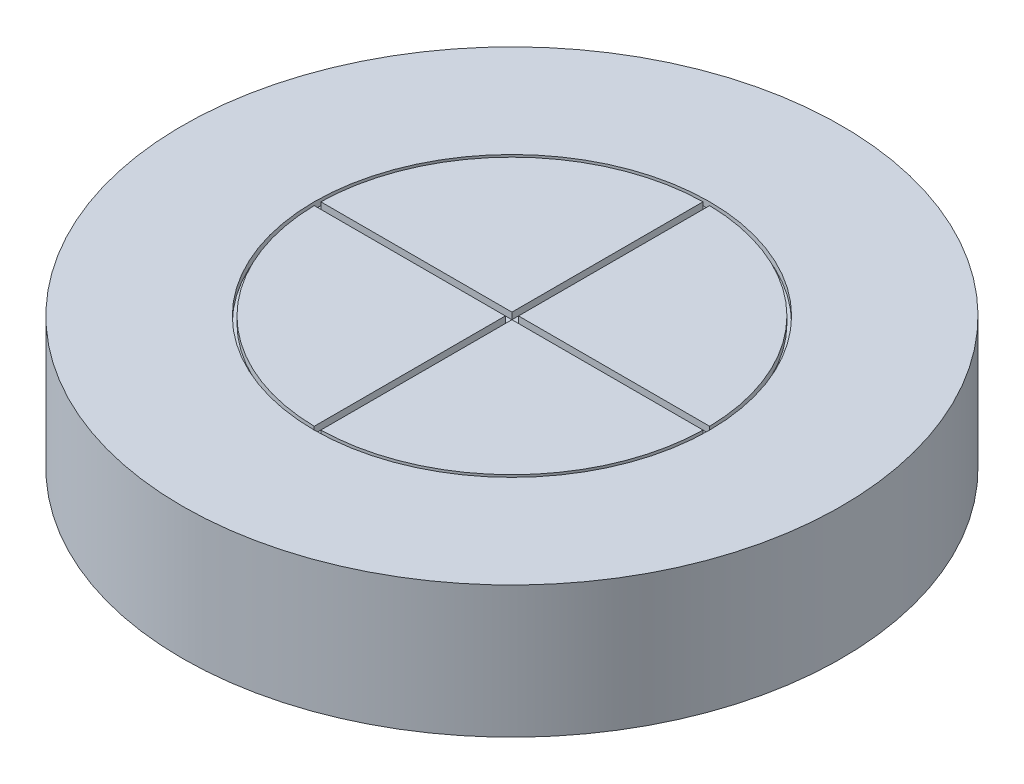
ISO-10303-21;
HEADER;
FILE_DESCRIPTION(('STEP AP214'),'2;1');
FILE_NAME('part.step','',(''),(''),'','','');
FILE_SCHEMA(('AUTOMOTIVE_DESIGN { 1 0 10303 214 1 1 1 1 }'));
ENDSEC;
DATA;
#1=APPLICATION_CONTEXT('core data for automotive mechanical design processes');
#2=APPLICATION_PROTOCOL_DEFINITION('international standard','automotive_design',2000,#1);
#3=PRODUCT_CONTEXT('',#1,'mechanical');
#4=PRODUCT('Part','Part','',(#3));
#5=PRODUCT_RELATED_PRODUCT_CATEGORY('part','',(#4));
#6=PRODUCT_DEFINITION_FORMATION('','',#4);
#7=PRODUCT_DEFINITION_CONTEXT('part definition',#1,'design');
#8=PRODUCT_DEFINITION('design','',#6,#7);
#9=PRODUCT_DEFINITION_SHAPE('','',#8);
#10=(LENGTH_UNIT() NAMED_UNIT(*) SI_UNIT(.MILLI.,.METRE.));
#11=(NAMED_UNIT(*) PLANE_ANGLE_UNIT() SI_UNIT($,.RADIAN.));
#12=(NAMED_UNIT(*) SI_UNIT($,.STERADIAN.) SOLID_ANGLE_UNIT());
#13=UNCERTAINTY_MEASURE_WITH_UNIT(LENGTH_MEASURE(1.E-05),#10,'distance_accuracy_value','');
#14=(GEOMETRIC_REPRESENTATION_CONTEXT(3) GLOBAL_UNCERTAINTY_ASSIGNED_CONTEXT((#13)) GLOBAL_UNIT_ASSIGNED_CONTEXT((#10,
#11,#12)) REPRESENTATION_CONTEXT('',''));
#15=CARTESIAN_POINT('',(0.,0.,0.));
#16=DIRECTION('',(0.,0.,1.));
#17=DIRECTION('',(1.,0.,0.));
#18=AXIS2_PLACEMENT_3D('',#15,#16,#17);
#19=CARTESIAN_POINT('',(0.,-20.,0.));
#20=DIRECTION('',(0.,1.,0.));
#21=DIRECTION('',(0.,0.,1.));
#22=AXIS2_PLACEMENT_3D('',#19,#20,#21);
#23=PLANE('',#22);
#24=CARTESIAN_POINT('',(0.,-20.,0.));
#25=DIRECTION('',(0.,1.,0.));
#26=DIRECTION('',(0.,0.,1.));
#27=AXIS2_PLACEMENT_3D('',#24,#25,#26);
#28=CIRCLE('',#27,50.);
#29=CARTESIAN_POINT('',(0.,-20.,50.));
#30=VERTEX_POINT('',#29);
#31=EDGE_CURVE('E45',#30,#30,#28,.T.);
#32=ORIENTED_EDGE('',*,*,#31,.F.);
#33=EDGE_LOOP('',(#32));
#34=FACE_BOUND('',#33,.T.);
#35=CARTESIAN_POINT('',(0.,-20.,0.));
#36=DIRECTION('',(0.,1.,0.));
#37=DIRECTION('',(0.,0.,1.));
#38=AXIS2_PLACEMENT_3D('',#35,#36,#37);
#39=CIRCLE('',#38,5.);
#40=CARTESIAN_POINT('',(0.,-20.,5.));
#41=VERTEX_POINT('',#40);
#42=EDGE_CURVE('E40',#41,#41,#39,.F.);
#43=ORIENTED_EDGE('',*,*,#42,.F.);
#44=EDGE_LOOP('',(#43));
#45=FACE_BOUND('',#44,.T.);
#46=ADVANCED_FACE('F35',(#34,#45),#23,.F.);
#47=CARTESIAN_POINT('',(0.,-20.,0.));
#48=DIRECTION('',(0.,1.,0.));
#49=DIRECTION('',(0.,0.,1.));
#50=AXIS2_PLACEMENT_3D('',#47,#48,#49);
#51=CYLINDRICAL_SURFACE('',#50,50.);
#52=CARTESIAN_POINT('',(-49.9211616215854,-9.83274433733847,2.80671023647724));
#53=CARTESIAN_POINT('',(-49.9211626786332,-9.67522407455325,2.80670329393147));
#54=CARTESIAN_POINT('',(-49.921915194245,-9.51759275665473,2.7934049361167));
#55=CARTESIAN_POINT('',(-49.9248443943695,-9.20668051723091,2.74054481317829));
#56=CARTESIAN_POINT('',(-49.927022747444,-9.05340491244823,2.70095227694744));
#57=CARTESIAN_POINT('',(-49.9325561018211,-8.75575284705154,2.59664265500738));
#58=CARTESIAN_POINT('',(-49.9359104933646,-8.61137182024867,2.53193858741226));
#59=CARTESIAN_POINT('',(-49.9434171874361,-8.33555865578487,2.37926310337919));
#60=CARTESIAN_POINT('',(-49.9475693041706,-8.20412351373204,2.29129710295483));
#61=CARTESIAN_POINT('',(-49.9562094446609,-7.95773167228149,2.09447439736692));
#62=CARTESIAN_POINT('',(-49.9606978294302,-7.84279308068754,1.98559503801747));
#63=CARTESIAN_POINT('',(-49.9695013811929,-7.63281171628202,1.7500823766324));
#64=CARTESIAN_POINT('',(-49.9738165410388,-7.53776976376587,1.62344834296919));
#65=CARTESIAN_POINT('',(-49.9817903515097,-7.37022682094381,1.35592251588829));
#66=CARTESIAN_POINT('',(-49.9854485781031,-7.2977403676108,1.21502160470009));
#67=CARTESIAN_POINT('',(-49.9916925767251,-7.1774592294477,0.923025755123028));
#68=CARTESIAN_POINT('',(-49.9942783584257,-7.12966432192957,0.771930908685094));
#69=CARTESIAN_POINT('',(-49.9980836412463,-7.06017201808922,0.464006703197084));
#70=CARTESIAN_POINT('',(-49.9993045935408,-7.03844690087618,0.307183618410665));
#71=CARTESIAN_POINT('',(-50.0002475156855,-7.02162529689937,-0.00788785448368556));
#72=CARTESIAN_POINT('',(-49.9999694996942,-7.02652855861806,-0.166136229114989));
#73=CARTESIAN_POINT('',(-49.9979470325986,-7.06280159039068,-0.47937846053933));
#74=CARTESIAN_POINT('',(-49.9962042341925,-7.09414153236913,-0.634375783531603));
#75=CARTESIAN_POINT('',(-49.9914503693535,-7.18235203716504,-0.936906140603366));
#76=CARTESIAN_POINT('',(-49.9884392965889,-7.239222727441,-1.08443913741421));
#77=CARTESIAN_POINT('',(-49.9814851470114,-7.37691428092108,-1.36794883638932));
#78=CARTESIAN_POINT('',(-49.9775415429064,-7.45774870080029,-1.50391894105514));
#79=CARTESIAN_POINT('',(-49.9691663100465,-7.64106324003476,-1.76037108422057));
#80=CARTESIAN_POINT('',(-49.964734676898,-7.74354355426778,-1.88085298326432));
#81=CARTESIAN_POINT('',(-49.9558750919624,-7.96740939198738,-2.10308269956175));
#82=CARTESIAN_POINT('',(-49.9514471536862,-8.08882079896277,-2.20480444512455));
#83=CARTESIAN_POINT('',(-49.9431002866875,-8.34701158415059,-2.38642542360706));
#84=CARTESIAN_POINT('',(-49.9391813581288,-8.48379096730924,-2.46632464950313));
#85=CARTESIAN_POINT('',(-49.9322949324866,-8.76885116531322,-2.60203046188099));
#86=CARTESIAN_POINT('',(-49.9293274762733,-8.91713247388144,-2.65783601346019));
#87=CARTESIAN_POINT('',(-49.9246801531007,-9.22098002866967,-2.74375267780214));
#88=CARTESIAN_POINT('',(-49.9230002739327,-9.37654620580017,-2.77386403419594));
#89=CARTESIAN_POINT('',(-49.9211198204804,-9.69032029162707,-2.80750520247922));
#90=CARTESIAN_POINT('',(-49.9209172309635,-9.84852430635261,-2.8110712261065));
#91=CARTESIAN_POINT('',(-49.9220089405233,-10.1632830015426,-2.79161505418821));
#92=CARTESIAN_POINT('',(-49.923303233337,-10.3198376889049,-2.76859296988592));
#93=CARTESIAN_POINT('',(-49.9272409977556,-10.6267516839244,-2.69664414967029));
#94=CARTESIAN_POINT('',(-49.9298836035945,-10.7771149003162,-2.64773403597875));
#95=CARTESIAN_POINT('',(-49.9362194327492,-11.0674982140949,-2.52541436378999));
#96=CARTESIAN_POINT('',(-49.9399126637456,-11.2075182358594,-2.45200462618966));
#97=CARTESIAN_POINT('',(-49.9479384087016,-11.4734069837429,-2.28267678632531));
#98=CARTESIAN_POINT('',(-49.9522716108405,-11.5992602159445,-2.18673438767223));
#99=CARTESIAN_POINT('',(-49.9610865231905,-11.8330869148165,-1.97510011168945));
#100=CARTESIAN_POINT('',(-49.9655682345842,-11.9410602390767,-1.85940807707242));
#101=CARTESIAN_POINT('',(-49.9741809694829,-12.1361841353158,-1.61140292061082));
#102=CARTESIAN_POINT('',(-49.9783115953986,-12.223311297262,-1.47907136469671));
#103=CARTESIAN_POINT('',(-49.9857509732316,-12.3741095421971,-1.20163652384935));
#104=CARTESIAN_POINT('',(-49.9890597294196,-12.4377807470725,-1.05653330528751));
#105=CARTESIAN_POINT('',(-49.9944806024592,-12.5398188491065,-0.757760698762084));
#106=CARTESIAN_POINT('',(-49.9965934239172,-12.5782006481647,-0.604096413451728));
#107=CARTESIAN_POINT('',(-49.9993871375351,-12.6286192056228,-0.292492430366928));
#108=CARTESIAN_POINT('',(-50.0000680405548,-12.6406561638244,-0.134552765026558));
#109=CARTESIAN_POINT('',(-49.9999212255348,-12.6380414576434,0.180886615165048));
#110=CARTESIAN_POINT('',(-49.9990955809136,-12.6234264735849,0.33838663634483));
#111=CARTESIAN_POINT('',(-49.9960326701271,-12.5679986809372,0.648692924289569));
#112=CARTESIAN_POINT('',(-49.993795401378,-12.5271858243991,0.801499182463193));
#113=CARTESIAN_POINT('',(-49.9881608340104,-12.4205287166817,1.09808691585712));
#114=CARTESIAN_POINT('',(-49.9847635337946,-12.3546844310357,1.24186837865052));
#115=CARTESIAN_POINT('',(-49.977190679521,-12.1998391960351,1.51633934857303));
#116=CARTESIAN_POINT('',(-49.9730151476356,-12.110838906385,1.64702922852876));
#117=CARTESIAN_POINT('',(-49.964348956374,-11.9120743059015,1.89179204972299));
#118=CARTESIAN_POINT('',(-49.9598579053423,-11.8022838911675,2.00584377804033));
#119=CARTESIAN_POINT('',(-49.951069771472,-11.5650829127722,2.21393474418601));
#120=CARTESIAN_POINT('',(-49.9467727365085,-11.4376680312886,2.30796906356736));
#121=CARTESIAN_POINT('',(-49.9388538431726,-11.1687138125569,2.47341178748877));
#122=CARTESIAN_POINT('',(-49.9352327252975,-11.0271592421659,2.54479543641452));
#123=CARTESIAN_POINT('',(-49.9290853584188,-10.734158416297,2.66269664718604));
#124=CARTESIAN_POINT('',(-49.92655782188,-10.5827240360567,2.70924346598675));
#125=CARTESIAN_POINT('',(-49.9235492518835,-10.3307535445565,2.76399184836783));
#126=CARTESIAN_POINT('',(-49.9226578634176,-10.2318479958679,2.77999067028247));
#127=CARTESIAN_POINT('',(-49.9214637127428,-10.0328913575267,2.80135206430255));
#128=CARTESIAN_POINT('',(-49.9211609498866,-9.93284026913388,2.80671464810388));
#129=CARTESIAN_POINT('',(-49.9211616215854,-9.83274433733847,2.80671023647724));
#130=B_SPLINE_CURVE_WITH_KNOTS('',3,(#52,#53,#54,#55,#56,#57,#58,#59,#60,#61,#62,#63,#64,#65,
#66,#67,#68,#69,#70,#71,#72,#73,#74,#75,#76,#77,#78,#79,#80,#81,#82,#83,#84,#85,#86,#87,#88,#89,
#90,#91,#92,#93,#94,#95,#96,#97,#98,#99,#100,#101,#102,#103,#104,#105,#106,#107,#108,#109,#110,
#111,#112,#113,#114,#115,#116,#117,#118,#119,#120,#121,#122,#123,#124,#125,#126,#127,#128,#129),
.UNSPECIFIED.,.T.,.F.,(4,2,2,2,2,2,2,2,2,2,2,2,2,2,2,2,2,2,2,2,2,2,2,2,2,2,2,2,2,2,2,2,2,2,2,2,
2,2,4),(0.,0.472195388713929,0.944944346312993,1.41744855194264,1.88984284239399,
2.36275176488018,2.835680180541,3.30891276928838,3.78214108997269,4.25486576379326,
4.72758597251503,5.19977353102633,5.67196344689092,6.14442099975217,6.61688280632502,
7.08999634287511,7.56311003169804,8.03624404028947,8.50937356259853,8.98185754817639,
9.45433955691258,9.92651856110492,10.3987010172104,10.8713949722346,11.3440926919985,
11.8173187809306,12.2905424107599,12.763486941399,13.2364278851707,13.7087184246892,
14.1810098286235,14.653301882876,15.1255804832061,15.5984560522682,16.0714476770944,
16.5449544825263,17.0179022744853,17.3179582073597,17.618013810284),.UNSPECIFIED.);
#131=CARTESIAN_POINT('',(-49.9211616215854,-9.83274433733847,2.80671023647724));
#132=VERTEX_POINT('',#131);
#133=EDGE_CURVE('E11',#132,#132,#130,.T.);
#134=ORIENTED_EDGE('',*,*,#133,.F.);
#135=EDGE_LOOP('',(#134));
#136=FACE_BOUND('',#135,.T.);
#137=ORIENTED_EDGE('',*,*,#31,.T.);
#138=EDGE_LOOP('',(#137));
#139=FACE_BOUND('',#138,.T.);
#140=CARTESIAN_POINT('',(0.,0.,0.));
#141=DIRECTION('',(0.,1.,0.));
#142=DIRECTION('',(0.,0.,1.));
#143=AXIS2_PLACEMENT_3D('',#140,#141,#142);
#144=CIRCLE('',#143,50.);
#145=CARTESIAN_POINT('',(0.,0.,50.));
#146=VERTEX_POINT('',#145);
#147=EDGE_CURVE('E160',#146,#146,#144,.T.);
#148=ORIENTED_EDGE('',*,*,#147,.F.);
#149=EDGE_LOOP('',(#148));
#150=FACE_BOUND('',#149,.T.);
#151=ADVANCED_FACE('F37',(#136,#139,#150),#51,.T.);
#152=CARTESIAN_POINT('',(0.,0.,0.));
#153=DIRECTION('',(0.,1.,0.));
#154=DIRECTION('',(0.,0.,1.));
#155=AXIS2_PLACEMENT_3D('',#152,#153,#154);
#156=PLANE('',#155);
#157=CARTESIAN_POINT('',(0.,0.,0.));
#158=DIRECTION('',(0.,1.,0.));
#159=DIRECTION('',(0.,0.,1.));
#160=AXIS2_PLACEMENT_3D('',#157,#158,#159);
#161=CIRCLE('',#160,30.);
#162=CARTESIAN_POINT('',(0.,0.,30.));
#163=VERTEX_POINT('',#162);
#164=EDGE_CURVE('E194',#163,#163,#161,.T.);
#165=ORIENTED_EDGE('',*,*,#164,.F.);
#166=EDGE_LOOP('',(#165));
#167=FACE_BOUND('',#166,.T.);
#168=ORIENTED_EDGE('',*,*,#147,.T.);
#169=EDGE_LOOP('',(#168));
#170=FACE_BOUND('',#169,.T.);
#171=ADVANCED_FACE('F295',(#167,#170),#156,.T.);
#172=CARTESIAN_POINT('',(0.,-1.,0.));
#173=DIRECTION('',(0.,1.,0.));
#174=DIRECTION('',(0.,0.,1.));
#175=AXIS2_PLACEMENT_3D('',#172,#173,#174);
#176=CYLINDRICAL_SURFACE('',#175,29.5);
#177=CARTESIAN_POINT('',(0.,0.,0.));
#178=DIRECTION('',(0.,1.,0.));
#179=DIRECTION('',(0.,0.,1.));
#180=AXIS2_PLACEMENT_3D('',#177,#178,#179);
#181=CIRCLE('',#180,29.5);
#182=CARTESIAN_POINT('',(-0.5,0.,-29.4957624075053));
#183=VERTEX_POINT('',#182);
#184=CARTESIAN_POINT('',(-29.4957624075053,0.,-0.5));
#185=VERTEX_POINT('',#184);
#186=EDGE_CURVE('E52',#183,#185,#181,.T.);
#187=ORIENTED_EDGE('',*,*,#186,.F.);
#188=DIRECTION('',(0.,1.,0.));
#189=VECTOR('',#188,1.);
#190=CARTESIAN_POINT('',(-0.5,-1.,-29.4957624075053));
#191=LINE('',#190,#189);
#192=CARTESIAN_POINT('',(-0.5,-1.,-29.4957624075053));
#193=VERTEX_POINT('',#192);
#194=EDGE_CURVE('E189',#193,#183,#191,.T.);
#195=ORIENTED_EDGE('',*,*,#194,.F.);
#196=CARTESIAN_POINT('',(0.,-1.,0.));
#197=DIRECTION('',(0.,1.,0.));
#198=DIRECTION('',(0.,0.,1.));
#199=AXIS2_PLACEMENT_3D('',#196,#197,#198);
#200=CIRCLE('',#199,29.5);
#201=CARTESIAN_POINT('',(-29.4957624075053,-1.,-0.5));
#202=VERTEX_POINT('',#201);
#203=EDGE_CURVE('E237',#193,#202,#200,.T.);
#204=ORIENTED_EDGE('',*,*,#203,.T.);
#205=DIRECTION('',(0.,1.,0.));
#206=VECTOR('',#205,1.);
#207=CARTESIAN_POINT('',(-29.4957624075053,-1.,-0.5));
#208=LINE('',#207,#206);
#209=EDGE_CURVE('E163',#202,#185,#208,.T.);
#210=ORIENTED_EDGE('',*,*,#209,.T.);
#211=EDGE_LOOP('',(#187,#195,#204,#210));
#212=FACE_BOUND('',#211,.T.);
#213=ADVANCED_FACE('F298',(#212),#176,.T.);
#214=CARTESIAN_POINT('',(0.,-1.,-0.5));
#215=DIRECTION('',(0.,0.,-1.));
#216=DIRECTION('',(-1.,0.,0.));
#217=AXIS2_PLACEMENT_3D('',#214,#215,#216);
#218=PLANE('',#217);
#219=DIRECTION('',(-1.,0.,0.));
#220=VECTOR('',#219,1.);
#221=CARTESIAN_POINT('',(0.,0.,-0.5));
#222=LINE('',#221,#220);
#223=CARTESIAN_POINT('',(-0.5,0.,-0.5));
#224=VERTEX_POINT('',#223);
#225=EDGE_CURVE('E198',#224,#185,#222,.T.);
#226=ORIENTED_EDGE('',*,*,#225,.T.);
#227=ORIENTED_EDGE('',*,*,#209,.F.);
#228=DIRECTION('',(-1.,0.,0.));
#229=VECTOR('',#228,1.);
#230=CARTESIAN_POINT('',(0.,-1.,-0.5));
#231=LINE('',#230,#229);
#232=CARTESIAN_POINT('',(-0.5,-1.,-0.5));
#233=VERTEX_POINT('',#232);
#234=EDGE_CURVE('E232',#233,#202,#231,.T.);
#235=ORIENTED_EDGE('',*,*,#234,.F.);
#236=DIRECTION('',(0.,1.,0.));
#237=VECTOR('',#236,1.);
#238=CARTESIAN_POINT('',(-0.5,-1.,-0.5));
#239=LINE('',#238,#237);
#240=EDGE_CURVE('E191',#233,#224,#239,.T.);
#241=ORIENTED_EDGE('',*,*,#240,.T.);
#242=EDGE_LOOP('',(#226,#227,#235,#241));
#243=FACE_BOUND('',#242,.T.);
#244=ADVANCED_FACE('F439',(#243),#218,.F.);
#245=CARTESIAN_POINT('',(0.,-1.,0.));
#246=DIRECTION('',(0.,1.,0.));
#247=DIRECTION('',(0.,0.,1.));
#248=AXIS2_PLACEMENT_3D('',#245,#246,#247);
#249=CYLINDRICAL_SURFACE('',#248,29.5);
#250=CARTESIAN_POINT('',(0.,0.,0.));
#251=DIRECTION('',(0.,1.,0.));
#252=DIRECTION('',(0.,0.,1.));
#253=AXIS2_PLACEMENT_3D('',#250,#251,#252);
#254=CIRCLE('',#253,29.5);
#255=CARTESIAN_POINT('',(29.4957624075053,0.,-0.5));
#256=VERTEX_POINT('',#255);
#257=CARTESIAN_POINT('',(0.5,0.,-29.4957624075053));
#258=VERTEX_POINT('',#257);
#259=EDGE_CURVE('E60',#256,#258,#254,.T.);
#260=ORIENTED_EDGE('',*,*,#259,.F.);
#261=DIRECTION('',(0.,1.,0.));
#262=VECTOR('',#261,1.);
#263=CARTESIAN_POINT('',(29.4957624075053,-1.,-0.5));
#264=LINE('',#263,#262);
#265=CARTESIAN_POINT('',(29.4957624075053,-1.,-0.5));
#266=VERTEX_POINT('',#265);
#267=EDGE_CURVE('E183',#266,#256,#264,.T.);
#268=ORIENTED_EDGE('',*,*,#267,.F.);
#269=CARTESIAN_POINT('',(0.,-1.,0.));
#270=DIRECTION('',(0.,1.,0.));
#271=DIRECTION('',(0.,0.,1.));
#272=AXIS2_PLACEMENT_3D('',#269,#270,#271);
#273=CIRCLE('',#272,29.5);
#274=CARTESIAN_POINT('',(0.5,-1.,-29.4957624075053));
#275=VERTEX_POINT('',#274);
#276=EDGE_CURVE('E245',#266,#275,#273,.T.);
#277=ORIENTED_EDGE('',*,*,#276,.T.);
#278=DIRECTION('',(0.,1.,0.));
#279=VECTOR('',#278,1.);
#280=CARTESIAN_POINT('',(0.5,-1.,-29.4957624075053));
#281=LINE('',#280,#279);
#282=EDGE_CURVE('E187',#275,#258,#281,.T.);
#283=ORIENTED_EDGE('',*,*,#282,.T.);
#284=EDGE_LOOP('',(#260,#268,#277,#283));
#285=FACE_BOUND('',#284,.T.);
#286=ADVANCED_FACE('F431',(#285),#249,.T.);
#287=CARTESIAN_POINT('',(0.5,-1.,0.));
#288=DIRECTION('',(1.,0.,0.));
#289=DIRECTION('',(0.,0.,-1.));
#290=AXIS2_PLACEMENT_3D('',#287,#288,#289);
#291=PLANE('',#290);
#292=DIRECTION('',(0.,0.,-1.));
#293=VECTOR('',#292,1.);
#294=CARTESIAN_POINT('',(0.5,0.,0.));
#295=LINE('',#294,#293);
#296=CARTESIAN_POINT('',(0.5,0.,-0.5));
#297=VERTEX_POINT('',#296);
#298=EDGE_CURVE('E205',#297,#258,#295,.T.);
#299=ORIENTED_EDGE('',*,*,#298,.T.);
#300=ORIENTED_EDGE('',*,*,#282,.F.);
#301=DIRECTION('',(0.,0.,-1.));
#302=VECTOR('',#301,1.);
#303=CARTESIAN_POINT('',(0.5,-1.,0.));
#304=LINE('',#303,#302);
#305=CARTESIAN_POINT('',(0.5,-1.,-0.5));
#306=VERTEX_POINT('',#305);
#307=EDGE_CURVE('E239',#306,#275,#304,.T.);
#308=ORIENTED_EDGE('',*,*,#307,.F.);
#309=DIRECTION('',(0.,1.,0.));
#310=VECTOR('',#309,1.);
#311=CARTESIAN_POINT('',(0.5,-1.,-0.5));
#312=LINE('',#311,#310);
#313=EDGE_CURVE('E185',#306,#297,#312,.T.);
#314=ORIENTED_EDGE('',*,*,#313,.T.);
#315=EDGE_LOOP('',(#299,#300,#308,#314));
#316=FACE_BOUND('',#315,.T.);
#317=ADVANCED_FACE('F423',(#316),#291,.F.);
#318=CARTESIAN_POINT('',(0.,-1.,0.));
#319=DIRECTION('',(0.,1.,0.));
#320=DIRECTION('',(0.,0.,1.));
#321=AXIS2_PLACEMENT_3D('',#318,#319,#320);
#322=CYLINDRICAL_SURFACE('',#321,29.5);
#323=CARTESIAN_POINT('',(0.,0.,0.));
#324=DIRECTION('',(0.,1.,0.));
#325=DIRECTION('',(0.,0.,1.));
#326=AXIS2_PLACEMENT_3D('',#323,#324,#325);
#327=CIRCLE('',#326,29.5);
#328=CARTESIAN_POINT('',(0.5,0.,29.4957624075053));
#329=VERTEX_POINT('',#328);
#330=CARTESIAN_POINT('',(29.4957624075053,0.,0.5));
#331=VERTEX_POINT('',#330);
#332=EDGE_CURVE('E218',#329,#331,#327,.T.);
#333=ORIENTED_EDGE('',*,*,#332,.F.);
#334=DIRECTION('',(0.,1.,0.));
#335=VECTOR('',#334,1.);
#336=CARTESIAN_POINT('',(0.5,-1.,29.4957624075053));
#337=LINE('',#336,#335);
#338=CARTESIAN_POINT('',(0.5,-1.,29.4957624075053));
#339=VERTEX_POINT('',#338);
#340=EDGE_CURVE('E175',#339,#329,#337,.T.);
#341=ORIENTED_EDGE('',*,*,#340,.F.);
#342=CARTESIAN_POINT('',(0.,-1.,0.));
#343=DIRECTION('',(0.,1.,0.));
#344=DIRECTION('',(0.,0.,1.));
#345=AXIS2_PLACEMENT_3D('',#342,#343,#344);
#346=CIRCLE('',#345,29.5);
#347=CARTESIAN_POINT('',(29.4957624075053,-1.,0.5));
#348=VERTEX_POINT('',#347);
#349=EDGE_CURVE('E252',#339,#348,#346,.T.);
#350=ORIENTED_EDGE('',*,*,#349,.T.);
#351=DIRECTION('',(0.,1.,0.));
#352=VECTOR('',#351,1.);
#353=CARTESIAN_POINT('',(29.4957624075053,-1.,0.5));
#354=LINE('',#353,#352);
#355=EDGE_CURVE('E180',#348,#331,#354,.T.);
#356=ORIENTED_EDGE('',*,*,#355,.T.);
#357=EDGE_LOOP('',(#333,#341,#350,#356));
#358=FACE_BOUND('',#357,.T.);
#359=ADVANCED_FACE('F415',(#358),#322,.T.);
#360=CARTESIAN_POINT('',(0.,-1.,0.5));
#361=DIRECTION('',(0.,0.,-1.));
#362=DIRECTION('',(-1.,0.,0.));
#363=AXIS2_PLACEMENT_3D('',#360,#361,#362);
#364=PLANE('',#363);
#365=DIRECTION('',(-1.,0.,0.));
#366=VECTOR('',#365,1.);
#367=CARTESIAN_POINT('',(0.,0.,0.5));
#368=LINE('',#367,#366);
#369=CARTESIAN_POINT('',(0.5,0.,0.5));
#370=VERTEX_POINT('',#369);
#371=EDGE_CURVE('E212',#331,#370,#368,.T.);
#372=ORIENTED_EDGE('',*,*,#371,.F.);
#373=ORIENTED_EDGE('',*,*,#355,.F.);
#374=DIRECTION('',(-1.,0.,0.));
#375=VECTOR('',#374,1.);
#376=CARTESIAN_POINT('',(0.,-1.,0.5));
#377=LINE('',#376,#375);
#378=CARTESIAN_POINT('',(0.5,-1.,0.5));
#379=VERTEX_POINT('',#378);
#380=EDGE_CURVE('E247',#348,#379,#377,.T.);
#381=ORIENTED_EDGE('',*,*,#380,.T.);
#382=DIRECTION('',(0.,1.,0.));
#383=VECTOR('',#382,1.);
#384=CARTESIAN_POINT('',(0.5,-1.,0.5));
#385=LINE('',#384,#383);
#386=EDGE_CURVE('E178',#379,#370,#385,.T.);
#387=ORIENTED_EDGE('',*,*,#386,.T.);
#388=EDGE_LOOP('',(#372,#373,#381,#387));
#389=FACE_BOUND('',#388,.T.);
#390=ADVANCED_FACE('F408',(#389),#364,.T.);
#391=CARTESIAN_POINT('',(0.,-1.,0.));
#392=DIRECTION('',(0.,1.,0.));
#393=DIRECTION('',(0.,0.,1.));
#394=AXIS2_PLACEMENT_3D('',#391,#392,#393);
#395=CYLINDRICAL_SURFACE('',#394,29.5);
#396=CARTESIAN_POINT('',(0.,0.,0.));
#397=DIRECTION('',(0.,1.,0.));
#398=DIRECTION('',(0.,0.,1.));
#399=AXIS2_PLACEMENT_3D('',#396,#397,#398);
#400=CIRCLE('',#399,29.5);
#401=CARTESIAN_POINT('',(-29.4957624075053,0.,0.5));
#402=VERTEX_POINT('',#401);
#403=CARTESIAN_POINT('',(-0.5,0.,29.4957624075053));
#404=VERTEX_POINT('',#403);
#405=EDGE_CURVE('E227',#402,#404,#400,.T.);
#406=ORIENTED_EDGE('',*,*,#405,.F.);
#407=DIRECTION('',(0.,1.,0.));
#408=VECTOR('',#407,1.);
#409=CARTESIAN_POINT('',(-29.4957624075053,-1.,0.5));
#410=LINE('',#409,#408);
#411=CARTESIAN_POINT('',(-29.4957624075053,-1.,0.5));
#412=VERTEX_POINT('',#411);
#413=EDGE_CURVE('E166',#412,#402,#410,.T.);
#414=ORIENTED_EDGE('',*,*,#413,.F.);
#415=CARTESIAN_POINT('',(0.,-1.,0.));
#416=DIRECTION('',(0.,1.,0.));
#417=DIRECTION('',(0.,0.,1.));
#418=AXIS2_PLACEMENT_3D('',#415,#416,#417);
#419=CIRCLE('',#418,29.5);
#420=CARTESIAN_POINT('',(-0.5,-1.,29.4957624075053));
#421=VERTEX_POINT('',#420);
#422=EDGE_CURVE('E197',#412,#421,#419,.T.);
#423=ORIENTED_EDGE('',*,*,#422,.T.);
#424=DIRECTION('',(0.,1.,0.));
#425=VECTOR('',#424,1.);
#426=CARTESIAN_POINT('',(-0.5,-1.,29.4957624075053));
#427=LINE('',#426,#425);
#428=EDGE_CURVE('E172',#421,#404,#427,.T.);
#429=ORIENTED_EDGE('',*,*,#428,.T.);
#430=EDGE_LOOP('',(#406,#414,#423,#429));
#431=FACE_BOUND('',#430,.T.);
#432=ADVANCED_FACE('F263',(#431),#395,.T.);
#433=CARTESIAN_POINT('',(-0.5,-1.,0.));
#434=DIRECTION('',(1.,0.,0.));
#435=DIRECTION('',(0.,0.,-1.));
#436=AXIS2_PLACEMENT_3D('',#433,#434,#435);
#437=PLANE('',#436);
#438=DIRECTION('',(0.,0.,-1.));
#439=VECTOR('',#438,1.);
#440=CARTESIAN_POINT('',(-0.5,0.,0.));
#441=LINE('',#440,#439);
#442=CARTESIAN_POINT('',(-0.5,0.,0.5));
#443=VERTEX_POINT('',#442);
#444=EDGE_CURVE('E221',#404,#443,#441,.T.);
#445=ORIENTED_EDGE('',*,*,#444,.F.);
#446=ORIENTED_EDGE('',*,*,#428,.F.);
#447=DIRECTION('',(0.,0.,-1.));
#448=VECTOR('',#447,1.);
#449=CARTESIAN_POINT('',(-0.5,-1.,0.));
#450=LINE('',#449,#448);
#451=CARTESIAN_POINT('',(-0.5,-1.,0.5));
#452=VERTEX_POINT('',#451);
#453=EDGE_CURVE('E255',#421,#452,#450,.T.);
#454=ORIENTED_EDGE('',*,*,#453,.T.);
#455=DIRECTION('',(0.,1.,0.));
#456=VECTOR('',#455,1.);
#457=CARTESIAN_POINT('',(-0.5,-1.,0.5));
#458=LINE('',#457,#456);
#459=EDGE_CURVE('E169',#452,#443,#458,.T.);
#460=ORIENTED_EDGE('',*,*,#459,.T.);
#461=EDGE_LOOP('',(#445,#446,#454,#460));
#462=FACE_BOUND('',#461,.T.);
#463=ADVANCED_FACE('F267',(#462),#437,.T.);
#464=CARTESIAN_POINT('',(-0.5,-1.,0.));
#465=DIRECTION('',(1.,0.,0.));
#466=DIRECTION('',(0.,0.,-1.));
#467=AXIS2_PLACEMENT_3D('',#464,#465,#466);
#468=PLANE('',#467);
#469=DIRECTION('',(0.,0.,-1.));
#470=VECTOR('',#469,1.);
#471=CARTESIAN_POINT('',(-0.5,0.,0.));
#472=LINE('',#471,#470);
#473=EDGE_CURVE('E201',#224,#183,#472,.T.);
#474=ORIENTED_EDGE('',*,*,#473,.F.);
#475=ORIENTED_EDGE('',*,*,#240,.F.);
#476=DIRECTION('',(0.,0.,-1.));
#477=VECTOR('',#476,1.);
#478=CARTESIAN_POINT('',(-0.5,-1.,0.));
#479=LINE('',#478,#477);
#480=EDGE_CURVE('E235',#233,#193,#479,.T.);
#481=ORIENTED_EDGE('',*,*,#480,.T.);
#482=ORIENTED_EDGE('',*,*,#194,.T.);
#483=EDGE_LOOP('',(#474,#475,#481,#482));
#484=FACE_BOUND('',#483,.T.);
#485=ADVANCED_FACE('F387',(#484),#468,.T.);
#486=CARTESIAN_POINT('',(0.,-1.,-0.5));
#487=DIRECTION('',(0.,0.,-1.));
#488=DIRECTION('',(-1.,0.,0.));
#489=AXIS2_PLACEMENT_3D('',#486,#487,#488);
#490=PLANE('',#489);
#491=DIRECTION('',(-1.,0.,0.));
#492=VECTOR('',#491,1.);
#493=CARTESIAN_POINT('',(0.,0.,-0.5));
#494=LINE('',#493,#492);
#495=EDGE_CURVE('E208',#256,#297,#494,.T.);
#496=ORIENTED_EDGE('',*,*,#495,.T.);
#497=ORIENTED_EDGE('',*,*,#313,.F.);
#498=DIRECTION('',(-1.,0.,0.));
#499=VECTOR('',#498,1.);
#500=CARTESIAN_POINT('',(0.,-1.,-0.5));
#501=LINE('',#500,#499);
#502=EDGE_CURVE('E242',#266,#306,#501,.T.);
#503=ORIENTED_EDGE('',*,*,#502,.F.);
#504=ORIENTED_EDGE('',*,*,#267,.T.);
#505=EDGE_LOOP('',(#496,#497,#503,#504));
#506=FACE_BOUND('',#505,.T.);
#507=ADVANCED_FACE('F379',(#506),#490,.F.);
#508=CARTESIAN_POINT('',(0.5,-1.,0.));
#509=DIRECTION('',(1.,0.,0.));
#510=DIRECTION('',(0.,0.,-1.));
#511=AXIS2_PLACEMENT_3D('',#508,#509,#510);
#512=PLANE('',#511);
#513=DIRECTION('',(0.,0.,-1.));
#514=VECTOR('',#513,1.);
#515=CARTESIAN_POINT('',(0.5,0.,0.));
#516=LINE('',#515,#514);
#517=EDGE_CURVE('E215',#329,#370,#516,.T.);
#518=ORIENTED_EDGE('',*,*,#517,.T.);
#519=ORIENTED_EDGE('',*,*,#386,.F.);
#520=DIRECTION('',(0.,0.,-1.));
#521=VECTOR('',#520,1.);
#522=CARTESIAN_POINT('',(0.5,-1.,0.));
#523=LINE('',#522,#521);
#524=EDGE_CURVE('E249',#339,#379,#523,.T.);
#525=ORIENTED_EDGE('',*,*,#524,.F.);
#526=ORIENTED_EDGE('',*,*,#340,.T.);
#527=EDGE_LOOP('',(#518,#519,#525,#526));
#528=FACE_BOUND('',#527,.T.);
#529=ADVANCED_FACE('F372',(#528),#512,.F.);
#530=CARTESIAN_POINT('',(0.,-1.,0.5));
#531=DIRECTION('',(0.,0.,-1.));
#532=DIRECTION('',(-1.,0.,0.));
#533=AXIS2_PLACEMENT_3D('',#530,#531,#532);
#534=PLANE('',#533);
#535=DIRECTION('',(-1.,0.,0.));
#536=VECTOR('',#535,1.);
#537=CARTESIAN_POINT('',(0.,0.,0.5));
#538=LINE('',#537,#536);
#539=EDGE_CURVE('E224',#443,#402,#538,.T.);
#540=ORIENTED_EDGE('',*,*,#539,.F.);
#541=ORIENTED_EDGE('',*,*,#459,.F.);
#542=DIRECTION('',(-1.,0.,0.));
#543=VECTOR('',#542,1.);
#544=CARTESIAN_POINT('',(0.,-1.,0.5));
#545=LINE('',#544,#543);
#546=EDGE_CURVE('E257',#452,#412,#545,.T.);
#547=ORIENTED_EDGE('',*,*,#546,.T.);
#548=ORIENTED_EDGE('',*,*,#413,.T.);
#549=EDGE_LOOP('',(#540,#541,#547,#548));
#550=FACE_BOUND('',#549,.T.);
#551=ADVANCED_FACE('F273',(#550),#534,.T.);
#552=CARTESIAN_POINT('',(0.,-1.,0.));
#553=DIRECTION('',(0.,1.,0.));
#554=DIRECTION('',(0.,0.,1.));
#555=AXIS2_PLACEMENT_3D('',#552,#553,#554);
#556=CYLINDRICAL_SURFACE('',#555,30.);
#557=CARTESIAN_POINT('',(0.,-1.,0.));
#558=DIRECTION('',(0.,1.,0.));
#559=DIRECTION('',(0.,0.,1.));
#560=AXIS2_PLACEMENT_3D('',#557,#558,#559);
#561=CIRCLE('',#560,30.);
#562=CARTESIAN_POINT('',(0.,-1.,30.));
#563=VERTEX_POINT('',#562);
#564=EDGE_CURVE('E170',#563,#563,#561,.T.);
#565=ORIENTED_EDGE('',*,*,#564,.F.);
#566=EDGE_LOOP('',(#565));
#567=FACE_BOUND('',#566,.T.);
#568=ORIENTED_EDGE('',*,*,#164,.T.);
#569=EDGE_LOOP('',(#568));
#570=FACE_BOUND('',#569,.T.);
#571=ADVANCED_FACE('F277',(#567,#570),#556,.F.);
#572=CARTESIAN_POINT('',(0.,-1.,0.));
#573=DIRECTION('',(0.,1.,0.));
#574=DIRECTION('',(0.,0.,1.));
#575=AXIS2_PLACEMENT_3D('',#572,#573,#574);
#576=PLANE('',#575);
#577=CARTESIAN_POINT('',(9.64002628020267E-06,-1.,-4.70879490118911E-06));
#578=DIRECTION('',(0.,1.,0.));
#579=DIRECTION('',(0.,0.,1.));
#580=AXIS2_PLACEMENT_3D('',#577,#578,#579);
#581=CIRCLE('',#580,0.507999999999999);
#582=CARTESIAN_POINT('',(9.64002628020267E-06,-1.,0.507995291205097));
#583=VERTEX_POINT('',#582);
#584=EDGE_CURVE('E141',#583,#583,#581,.T.);
#585=ORIENTED_EDGE('',*,*,#584,.F.);
#586=EDGE_LOOP('',(#585));
#587=FACE_BOUND('',#586,.T.);
#588=ORIENTED_EDGE('',*,*,#422,.F.);
#589=ORIENTED_EDGE('',*,*,#546,.F.);
#590=ORIENTED_EDGE('',*,*,#453,.F.);
#591=EDGE_LOOP('',(#588,#589,#590));
#592=FACE_BOUND('',#591,.T.);
#593=ORIENTED_EDGE('',*,*,#349,.F.);
#594=ORIENTED_EDGE('',*,*,#524,.T.);
#595=ORIENTED_EDGE('',*,*,#380,.F.);
#596=EDGE_LOOP('',(#593,#594,#595));
#597=FACE_BOUND('',#596,.T.);
#598=ORIENTED_EDGE('',*,*,#276,.F.);
#599=ORIENTED_EDGE('',*,*,#502,.T.);
#600=ORIENTED_EDGE('',*,*,#307,.T.);
#601=EDGE_LOOP('',(#598,#599,#600));
#602=FACE_BOUND('',#601,.T.);
#603=ORIENTED_EDGE('',*,*,#203,.F.);
#604=ORIENTED_EDGE('',*,*,#480,.F.);
#605=ORIENTED_EDGE('',*,*,#234,.T.);
#606=EDGE_LOOP('',(#603,#604,#605));
#607=FACE_BOUND('',#606,.T.);
#608=ORIENTED_EDGE('',*,*,#564,.T.);
#609=EDGE_LOOP('',(#608));
#610=FACE_BOUND('',#609,.T.);
#611=ADVANCED_FACE('F274',(#587,#592,#597,#602,#607,#610),#576,.T.);
#612=ORIENTED_EDGE('',*,*,#539,.T.);
#613=ORIENTED_EDGE('',*,*,#405,.T.);
#614=ORIENTED_EDGE('',*,*,#444,.T.);
#615=EDGE_LOOP('',(#612,#613,#614));
#616=FACE_BOUND('',#615,.T.);
#617=ADVANCED_FACE('F271',(#616),#156,.T.);
#618=ORIENTED_EDGE('',*,*,#517,.F.);
#619=ORIENTED_EDGE('',*,*,#332,.T.);
#620=ORIENTED_EDGE('',*,*,#371,.T.);
#621=EDGE_LOOP('',(#618,#619,#620));
#622=FACE_BOUND('',#621,.T.);
#623=ADVANCED_FACE('F347',(#622),#156,.T.);
#624=ORIENTED_EDGE('',*,*,#495,.F.);
#625=ORIENTED_EDGE('',*,*,#259,.T.);
#626=ORIENTED_EDGE('',*,*,#298,.F.);
#627=EDGE_LOOP('',(#624,#625,#626));
#628=FACE_BOUND('',#627,.T.);
#629=ADVANCED_FACE('F339',(#628),#156,.T.);
#630=ORIENTED_EDGE('',*,*,#473,.T.);
#631=ORIENTED_EDGE('',*,*,#186,.T.);
#632=ORIENTED_EDGE('',*,*,#225,.F.);
#633=EDGE_LOOP('',(#630,#631,#632));
#634=FACE_BOUND('',#633,.T.);
#635=ADVANCED_FACE('F299',(#634),#156,.T.);
#636=CARTESIAN_POINT('',(9.64002628020267E-06,-1.,-4.70879490118911E-06));
#637=DIRECTION('',(0.,1.,0.));
#638=DIRECTION('',(0.,0.,1.));
#639=AXIS2_PLACEMENT_3D('',#636,#637,#638);
#640=CYLINDRICAL_SURFACE('',#639,0.507999999999998);
#641=CARTESIAN_POINT('',(9.64002628020267E-06,-7.07239912810985,0.507995291205097));
#642=CARTESIAN_POINT('',(-0.0282730628542977,-7.07239858964247,0.50799418848679));
#643=CARTESIAN_POINT('',(-0.0565702867166851,-7.07195973235034,0.505625339459095));
#644=CARTESIAN_POINT('',(-0.112368102494791,-7.07025371850665,0.4962181802131));
#645=CARTESIAN_POINT('',(-0.139867977695789,-7.06898583948859,0.489175797076098));
#646=CARTESIAN_POINT('',(-0.193255622680081,-7.06576997701572,0.470643844170472));
#647=CARTESIAN_POINT('',(-0.219144819646661,-7.06382260605449,0.459158278473731));
#648=CARTESIAN_POINT('',(-0.268626790841858,-7.05946790560783,0.432076404659098));
#649=CARTESIAN_POINT('',(-0.292219769556021,-7.05706061713619,0.41648046304276));
#650=CARTESIAN_POINT('',(-0.336715457731066,-7.05202611943819,0.381427603999779));
#651=CARTESIAN_POINT('',(-0.357587653035207,-7.04939688428728,0.361932237582875));
#652=CARTESIAN_POINT('',(-0.395783692658155,-7.04423267112322,0.3197170314485));
#653=CARTESIAN_POINT('',(-0.413107311564525,-7.04169769910621,0.296996987048337));
#654=CARTESIAN_POINT('',(-0.44383061122424,-7.03698601598171,0.248777793920459));
#655=CARTESIAN_POINT('',(-0.457201639645723,-7.03481196866486,0.223260106546953));
#656=CARTESIAN_POINT('',(-0.479455746793027,-7.03108973001297,0.170294730434589));
#657=CARTESIAN_POINT('',(-0.488339169342004,-7.02954149073272,0.142847189737306));
#658=CARTESIAN_POINT('',(-0.501271863384287,-7.02725962417036,0.0871171769171509));
#659=CARTESIAN_POINT('',(-0.505372525779016,-7.02651734294271,0.0588469907221296));
#660=CARTESIAN_POINT('',(-0.508783319356373,-7.02590123451911,0.00201078704233759));
#661=CARTESIAN_POINT('',(-0.508093831793614,-7.0260273382072,-0.0265552067180028));
#662=CARTESIAN_POINT('',(-0.50198352614952,-7.02712700358975,-0.0828200614175857));
#663=CARTESIAN_POINT('',(-0.496618032409948,-7.02809065544259,-0.110525152092823));
#664=CARTESIAN_POINT('',(-0.481395397184422,-7.03074605497879,-0.164635167489189));
#665=CARTESIAN_POINT('',(-0.471538100395718,-7.0324378278366,-0.191040047220933));
#666=CARTESIAN_POINT('',(-0.447558221672386,-7.03637605424258,-0.241961902350026));
#667=CARTESIAN_POINT('',(-0.43341330228411,-7.03862540115158,-0.266468125799231));
#668=CARTESIAN_POINT('',(-0.401276127953524,-7.04342964510686,-0.312779903241993));
#669=CARTESIAN_POINT('',(-0.383283507505538,-7.04598457117093,-0.334585200354763));
#670=CARTESIAN_POINT('',(-0.343656146271128,-7.05115971590255,-0.375203667757404));
#671=CARTESIAN_POINT('',(-0.321973015855534,-7.05378034583072,-0.393969607137248));
#672=CARTESIAN_POINT('',(-0.275741928532659,-7.05875649330908,-0.427605265502984));
#673=CARTESIAN_POINT('',(-0.251193935164695,-7.06111200748442,-0.442474934893811));
#674=CARTESIAN_POINT('',(-0.199869888758951,-7.06529170552948,-0.467908051514339));
#675=CARTESIAN_POINT('',(-0.173090555438954,-7.0671150887467,-0.47846501923021));
#676=CARTESIAN_POINT('',(-0.118097990200866,-7.07001152204609,-0.494916887336618));
#677=CARTESIAN_POINT('',(-0.0898849091983012,-7.07108465092488,-0.500812277325072));
#678=CARTESIAN_POINT('',(-0.0332505490908045,-7.07234358950825,-0.507705480365595));
#679=CARTESIAN_POINT('',(-0.00483777264354364,-7.07254166117905,-0.508770979087171));
#680=CARTESIAN_POINT('',(0.0517598291831904,-7.07206082231101,-0.506155247686393));
#681=CARTESIAN_POINT('',(0.0799446649679307,-7.07138195203368,-0.502474235482429));
#682=CARTESIAN_POINT('',(0.135066249493073,-7.06923511206264,-0.490527952260757));
#683=CARTESIAN_POINT('',(0.1620108724437,-7.06777319503967,-0.482297828859404));
#684=CARTESIAN_POINT('',(0.214138632234881,-7.06423015161891,-0.461524098788595));
#685=CARTESIAN_POINT('',(0.239321646888539,-7.06214898232165,-0.448980193267237));
#686=CARTESIAN_POINT('',(0.287510514461759,-7.05757381988123,-0.419777910589643));
#687=CARTESIAN_POINT('',(0.310489927362374,-7.05507561243131,-0.403076575339316));
#688=CARTESIAN_POINT('',(0.353344479808536,-7.04995986081892,-0.366091783581722));
#689=CARTESIAN_POINT('',(0.373219359822548,-7.04734230670296,-0.345808027894346));
#690=CARTESIAN_POINT('',(0.409551689247775,-7.0422435863614,-0.301932652019524));
#691=CARTESIAN_POINT('',(0.425963739854307,-7.03976451210678,-0.278303157028092));
#692=CARTESIAN_POINT('',(0.454584913826833,-7.03525672469296,-0.228582993293563));
#693=CARTESIAN_POINT('',(0.466794191052152,-7.03322799504805,-0.202492414692834));
#694=CARTESIAN_POINT('',(0.48659440688024,-7.02985850361677,-0.148719174027759));
#695=CARTESIAN_POINT('',(0.494208111191372,-7.02851435579108,-0.121045116093226));
#696=CARTESIAN_POINT('',(0.504673936449997,-7.02665106931328,-0.0647845683123676));
#697=CARTESIAN_POINT('',(0.507526522787493,-7.02613185002625,-0.0361981679241553));
#698=CARTESIAN_POINT('',(0.508373842671993,-7.0259783722437,0.0206393385143604));
#699=CARTESIAN_POINT('',(0.506437304404507,-7.02633159336379,0.0488894093400261));
#700=CARTESIAN_POINT('',(0.497911264808993,-7.02785743595728,0.104654678187715));
#701=CARTESIAN_POINT('',(0.491321801710056,-7.02903005069842,0.132169882245581));
#702=CARTESIAN_POINT('',(0.473705107691717,-7.03206310408748,0.185651278992559));
#703=CARTESIAN_POINT('',(0.462684720297732,-7.03392248167723,0.211619789846435));
#704=CARTESIAN_POINT('',(0.436527041290413,-7.03812723174151,0.26134952482055));
#705=CARTESIAN_POINT('',(0.421389499374878,-7.0404726337618,0.285110614622873));
#706=CARTESIAN_POINT('',(0.387188328670835,-7.04542987000015,0.330094739936055));
#707=CARTESIAN_POINT('',(0.368074820160946,-7.04804485259002,0.351279509570484));
#708=CARTESIAN_POINT('',(0.326568220768311,-7.05322604384041,0.390164935764894));
#709=CARTESIAN_POINT('',(0.304174361285894,-7.05579224091064,0.407864773506525));
#710=CARTESIAN_POINT('',(0.256514750734512,-7.06060912552834,0.439418793149414));
#711=CARTESIAN_POINT('',(0.231226140259244,-7.06285693627739,0.453238897794954));
#712=CARTESIAN_POINT('',(0.178654307452465,-7.06674815108426,0.476412819452389));
#713=CARTESIAN_POINT('',(0.151373033070587,-7.06839213618379,0.485770932692743));
#714=CARTESIAN_POINT('',(0.103337039903272,-7.07053963218227,0.497810673850529));
#715=CARTESIAN_POINT('',(0.0828668581650808,-7.0712328897531,0.501623497878711));
#716=CARTESIAN_POINT('',(0.0416036106159943,-7.07216283024387,0.506716181632881));
#717=CARTESIAN_POINT('',(0.0208105525746762,-7.07239952413327,0.507996102214821));
#718=CARTESIAN_POINT('',(9.64002628020267E-06,-7.07239912810985,0.507995291205097));
#719=B_SPLINE_CURVE_WITH_KNOTS('',3,(#641,#642,#643,#644,#645,#646,#647,#648,#649,#650,#651,
#652,#653,#654,#655,#656,#657,#658,#659,#660,#661,#662,#663,#664,#665,#666,#667,#668,#669,#670,
#671,#672,#673,#674,#675,#676,#677,#678,#679,#680,#681,#682,#683,#684,#685,#686,#687,#688,#689,
#690,#691,#692,#693,#694,#695,#696,#697,#698,#699,#700,#701,#702,#703,#704,#705,#706,#707,#708,
#709,#710,#711,#712,#713,#714,#715,#716,#717,#718),.UNSPECIFIED.,.T.,.F.,(4,2,2,2,2,2,2,2,2,2,2,
2,2,2,2,2,2,2,2,2,2,2,2,2,2,2,2,2,2,2,2,2,2,2,2,2,2,2,4),(0.,0.0847720062299028,
0.169617987248623,0.254387684892252,0.339149826603811,0.424793055971447,0.510441723876792,
0.596696835278664,0.682945337141943,0.768258300290175,0.853564473340307,0.937874839189162,
1.02218812026495,1.10694843060595,1.19171679618481,1.27769698673054,1.36367827165265,
1.44978826613528,1.53588921542369,1.62077974622497,1.70566637973212,1.78990614364429,
1.87415174472816,1.95930686780627,2.04446910584385,2.13068663044735,2.21690099837781,
2.30268469239362,2.38846000072937,2.47301151977098,2.55756234413338,2.64198307903975,
2.72640894744809,2.81196584081328,2.89754281266891,2.98384946630807,3.07007285092926,
3.13242111599063,3.19476788304418),.UNSPECIFIED.);
#720=CARTESIAN_POINT('',(9.64002628020267E-06,-7.07239912810985,0.507995291205097));
#721=VERTEX_POINT('',#720);
#722=EDGE_CURVE('E138',#721,#721,#719,.T.);
#723=ORIENTED_EDGE('',*,*,#722,.T.);
#724=EDGE_LOOP('',(#723));
#725=FACE_BOUND('',#724,.T.);
#726=ORIENTED_EDGE('',*,*,#584,.T.);
#727=EDGE_LOOP('',(#726));
#728=FACE_BOUND('',#727,.T.);
#729=ADVANCED_FACE('F150',(#725,#728),#640,.F.);
#730=CARTESIAN_POINT('',(-49.999999999999,-9.83274433733847,1.02526432261284E-05));
#731=DIRECTION('',(-0.999999999999979,0.,2.05052864282228E-07));
#732=DIRECTION('',(2.05052864282228E-07,0.,0.999999999999979));
#733=AXIS2_PLACEMENT_3D('',#730,#731,#732);
#734=CYLINDRICAL_SURFACE('',#733,2.80669999999999);
#735=CARTESIAN_POINT('',(4.99999999999992,-9.83274433733847,-1.02526430939413E-06));
#736=DIRECTION('',(-0.999999999999979,0.,2.05052864282228E-07));
#737=DIRECTION('',(2.05052864282228E-07,0.,0.999999999999979));
#738=AXIS2_PLACEMENT_3D('',#735,#736,#737);
#739=CIRCLE('',#738,2.80669999999999);
#740=CARTESIAN_POINT('',(5.0000005755218,-9.83274433733847,2.80669897473562));
#741=VERTEX_POINT('',#740);
#742=EDGE_CURVE('E136',#741,#741,#739,.T.);
#743=ORIENTED_EDGE('',*,*,#742,.F.);
#744=EDGE_LOOP('',(#743));
#745=FACE_BOUND('',#744,.T.);
#746=ORIENTED_EDGE('',*,*,#133,.T.);
#747=EDGE_LOOP('',(#746));
#748=FACE_BOUND('',#747,.T.);
#749=ORIENTED_EDGE('',*,*,#722,.F.);
#750=EDGE_LOOP('',(#749));
#751=FACE_BOUND('',#750,.T.);
#752=ADVANCED_FACE('F132',(#745,#748,#751),#734,.F.);
#753=CARTESIAN_POINT('',(4.99999999999992,-9.83274433733847,-1.02526430939413E-06));
#754=DIRECTION('',(-0.999999999999979,0.,2.05052864282228E-07));
#755=DIRECTION('',(2.05052864282228E-07,0.,0.999999999999979));
#756=AXIS2_PLACEMENT_3D('',#753,#754,#755);
#757=CONICAL_SURFACE('',#756,2.80669999999999,1.02974425867665);
#758=CARTESIAN_POINT('',(6.68643549942451,-9.83274433733849,-1.37107273897838E-06));
#759=VERTEX_POINT('',#758);
#760=VERTEX_LOOP('',#759);
#761=FACE_BOUND('',#760,.T.);
#762=ORIENTED_EDGE('',*,*,#742,.T.);
#763=EDGE_LOOP('',(#762));
#764=FACE_BOUND('',#763,.T.);
#765=ADVANCED_FACE('F128',(#761,#764),#757,.F.);
#766=CARTESIAN_POINT('',(0.,-20.,0.));
#767=DIRECTION('',(1.,0.,0.));
#768=DIRECTION('',(0.,0.,-1.));
#769=AXIS2_PLACEMENT_3D('',#766,#767,#768);
#770=SPHERICAL_SURFACE('',#769,5.);
#771=CARTESIAN_POINT('',(0.,-20.,0.));
#772=DIRECTION('',(0.,1.,0.));
#773=DIRECTION('',(0.,0.,1.));
#774=AXIS2_PLACEMENT_3D('',#771,#772,#773);
#775=SPHERICAL_SURFACE('',#774,5.);
#776=ORIENTED_EDGE('',*,*,#42,.T.);
#777=EDGE_LOOP('',(#776));
#778=FACE_BOUND('',#777,.T.);
#779=ADVANCED_FACE('F131',(#778),#775,.F.);
#780=CLOSED_SHELL('',(#46,#151,#171,#213,#244,#286,#317,#359,#390,#432,#463,#485,#507,#529,#551,
#571,#611,#617,#623,#629,#635,#729,#752,#765,#779));
#781=MANIFOLD_SOLID_BREP('B2',#780);
#782=ADVANCED_BREP_SHAPE_REPRESENTATION('',(#18,#781),#14);
#783=SHAPE_DEFINITION_REPRESENTATION(#9,#782);
ENDSEC;
END-ISO-10303-21;
